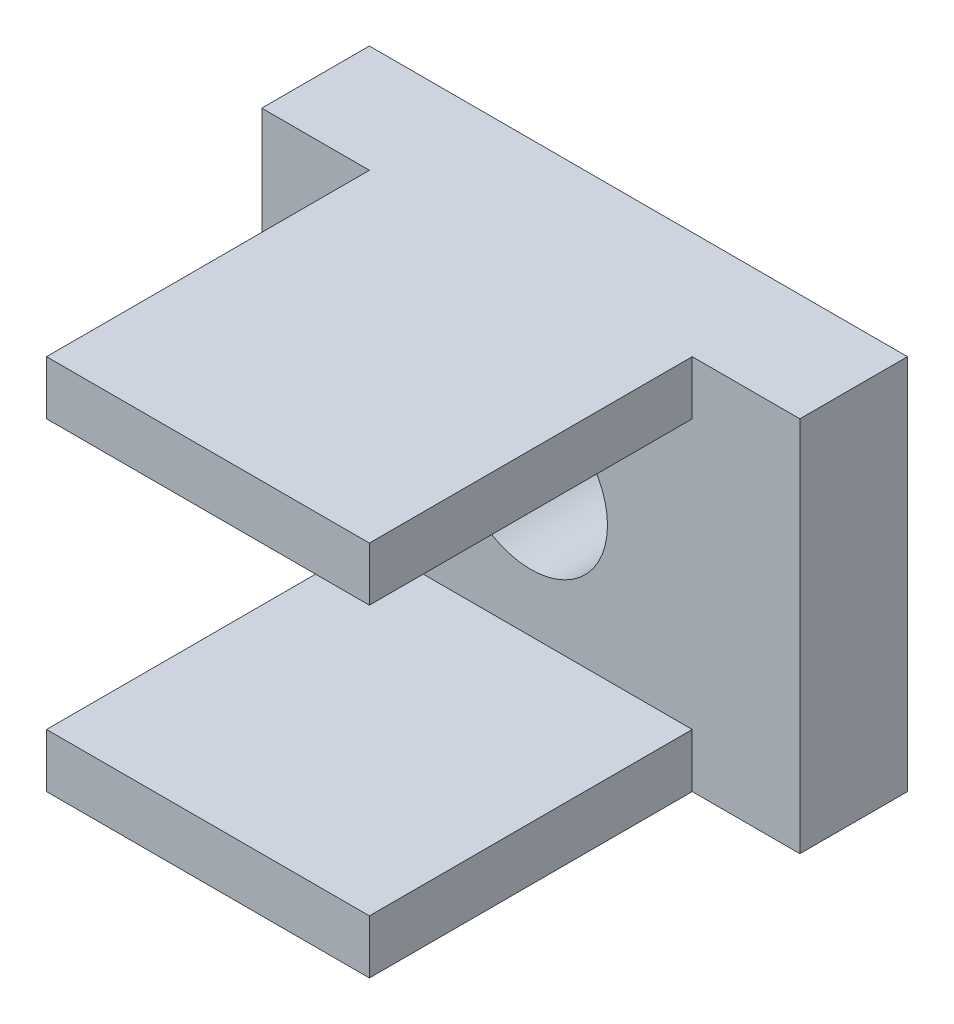
ISO-10303-21;
HEADER;
FILE_DESCRIPTION(('STEP AP214'),'2;1');
FILE_NAME('part.step','',(''),(''),'','','');
FILE_SCHEMA(('AUTOMOTIVE_DESIGN { 1 0 10303 214 1 1 1 1 }'));
ENDSEC;
DATA;
#1=APPLICATION_CONTEXT('core data for automotive mechanical design processes');
#2=APPLICATION_PROTOCOL_DEFINITION('international standard','automotive_design',2000,#1);
#3=PRODUCT_CONTEXT('',#1,'mechanical');
#4=PRODUCT('Part','Part','',(#3));
#5=PRODUCT_RELATED_PRODUCT_CATEGORY('part','',(#4));
#6=PRODUCT_DEFINITION_FORMATION('','',#4);
#7=PRODUCT_DEFINITION_CONTEXT('part definition',#1,'design');
#8=PRODUCT_DEFINITION('design','',#6,#7);
#9=PRODUCT_DEFINITION_SHAPE('','',#8);
#10=(LENGTH_UNIT() NAMED_UNIT(*) SI_UNIT(.MILLI.,.METRE.));
#11=(NAMED_UNIT(*) PLANE_ANGLE_UNIT() SI_UNIT($,.RADIAN.));
#12=(NAMED_UNIT(*) SI_UNIT($,.STERADIAN.) SOLID_ANGLE_UNIT());
#13=UNCERTAINTY_MEASURE_WITH_UNIT(LENGTH_MEASURE(1.E-05),#10,'distance_accuracy_value','');
#14=(GEOMETRIC_REPRESENTATION_CONTEXT(3) GLOBAL_UNCERTAINTY_ASSIGNED_CONTEXT((#13)) GLOBAL_UNIT_ASSIGNED_CONTEXT((#10,
#11,#12)) REPRESENTATION_CONTEXT('',''));
#15=CARTESIAN_POINT('',(0.,0.,0.));
#16=DIRECTION('',(0.,0.,1.));
#17=DIRECTION('',(1.,0.,0.));
#18=AXIS2_PLACEMENT_3D('',#15,#16,#17);
#19=CARTESIAN_POINT('',(0.,0.,2.));
#20=DIRECTION('',(0.,0.,1.));
#21=DIRECTION('',(1.,0.,0.));
#22=AXIS2_PLACEMENT_3D('',#19,#20,#21);
#23=PLANE('',#22);
#24=DIRECTION('',(0.,1.,0.));
#25=VECTOR('',#24,1.);
#26=CARTESIAN_POINT('',(-3.,-2.5,2.));
#27=LINE('',#26,#25);
#28=CARTESIAN_POINT('',(-3.,-3.5,2.));
#29=VERTEX_POINT('',#28);
#30=CARTESIAN_POINT('',(-3.,-2.5,2.));
#31=VERTEX_POINT('',#30);
#32=EDGE_CURVE('E55',#29,#31,#27,.T.);
#33=ORIENTED_EDGE('',*,*,#32,.T.);
#34=DIRECTION('',(1.,0.,0.));
#35=VECTOR('',#34,1.);
#36=CARTESIAN_POINT('',(3.,-2.5,2.));
#37=LINE('',#36,#35);
#38=CARTESIAN_POINT('',(3.,-2.5,2.));
#39=VERTEX_POINT('',#38);
#40=EDGE_CURVE('E60',#31,#39,#37,.T.);
#41=ORIENTED_EDGE('',*,*,#40,.T.);
#42=DIRECTION('',(0.,-1.,0.));
#43=VECTOR('',#42,1.);
#44=CARTESIAN_POINT('',(3.,-2.5,2.));
#45=LINE('',#44,#43);
#46=CARTESIAN_POINT('',(3.,-3.5,2.));
#47=VERTEX_POINT('',#46);
#48=EDGE_CURVE('E163',#39,#47,#45,.T.);
#49=ORIENTED_EDGE('',*,*,#48,.T.);
#50=DIRECTION('',(1.,0.,0.));
#51=VECTOR('',#50,1.);
#52=CARTESIAN_POINT('',(5.,-3.5,2.));
#53=LINE('',#52,#51);
#54=CARTESIAN_POINT('',(5.,-3.5,2.));
#55=VERTEX_POINT('',#54);
#56=EDGE_CURVE('E228',#47,#55,#53,.T.);
#57=ORIENTED_EDGE('',*,*,#56,.T.);
#58=DIRECTION('',(0.,1.,0.));
#59=VECTOR('',#58,1.);
#60=CARTESIAN_POINT('',(5.,-3.5,2.));
#61=LINE('',#60,#59);
#62=CARTESIAN_POINT('',(5.,3.5,2.));
#63=VERTEX_POINT('',#62);
#64=EDGE_CURVE('E233',#55,#63,#61,.T.);
#65=ORIENTED_EDGE('',*,*,#64,.T.);
#66=DIRECTION('',(-1.,0.,0.));
#67=VECTOR('',#66,1.);
#68=CARTESIAN_POINT('',(5.,3.5,2.));
#69=LINE('',#68,#67);
#70=CARTESIAN_POINT('',(3.,3.5,2.));
#71=VERTEX_POINT('',#70);
#72=EDGE_CURVE('E237',#63,#71,#69,.T.);
#73=ORIENTED_EDGE('',*,*,#72,.T.);
#74=DIRECTION('',(0.,1.,0.));
#75=VECTOR('',#74,1.);
#76=CARTESIAN_POINT('',(3.,2.5,2.));
#77=LINE('',#76,#75);
#78=CARTESIAN_POINT('',(3.,2.5,2.));
#79=VERTEX_POINT('',#78);
#80=EDGE_CURVE('E180',#79,#71,#77,.T.);
#81=ORIENTED_EDGE('',*,*,#80,.F.);
#82=DIRECTION('',(1.,0.,0.));
#83=VECTOR('',#82,1.);
#84=CARTESIAN_POINT('',(3.,2.5,2.));
#85=LINE('',#84,#83);
#86=CARTESIAN_POINT('',(-3.,2.5,2.));
#87=VERTEX_POINT('',#86);
#88=EDGE_CURVE('E193',#87,#79,#85,.T.);
#89=ORIENTED_EDGE('',*,*,#88,.F.);
#90=DIRECTION('',(0.,-1.,0.));
#91=VECTOR('',#90,1.);
#92=CARTESIAN_POINT('',(-3.,2.5,2.));
#93=LINE('',#92,#91);
#94=CARTESIAN_POINT('',(-3.,3.5,2.));
#95=VERTEX_POINT('',#94);
#96=EDGE_CURVE('E137',#95,#87,#93,.T.);
#97=ORIENTED_EDGE('',*,*,#96,.F.);
#98=CARTESIAN_POINT('',(-5.,3.5,2.));
#99=VERTEX_POINT('',#98);
#100=EDGE_CURVE('E236',#95,#99,#69,.T.);
#101=ORIENTED_EDGE('',*,*,#100,.T.);
#102=DIRECTION('',(0.,-1.,0.));
#103=VECTOR('',#102,1.);
#104=CARTESIAN_POINT('',(-5.,-3.5,2.));
#105=LINE('',#104,#103);
#106=CARTESIAN_POINT('',(-5.,-3.5,2.));
#107=VERTEX_POINT('',#106);
#108=EDGE_CURVE('E224',#99,#107,#105,.T.);
#109=ORIENTED_EDGE('',*,*,#108,.T.);
#110=EDGE_CURVE('E230',#107,#29,#53,.T.);
#111=ORIENTED_EDGE('',*,*,#110,.T.);
#112=EDGE_LOOP('',(#33,#41,#49,#57,#65,#73,#81,#89,#97,#101,#109,#111));
#113=FACE_BOUND('',#112,.T.);
#114=CARTESIAN_POINT('',(0.,0.,2.));
#115=DIRECTION('',(0.,0.,1.));
#116=DIRECTION('',(1.,0.,0.));
#117=AXIS2_PLACEMENT_3D('',#114,#115,#116);
#118=CIRCLE('',#117,1.425);
#119=CARTESIAN_POINT('',(1.425,0.,2.));
#120=VERTEX_POINT('',#119);
#121=EDGE_CURVE('E216',#120,#120,#118,.T.);
#122=ORIENTED_EDGE('',*,*,#121,.F.);
#123=EDGE_LOOP('',(#122));
#124=FACE_BOUND('',#123,.T.);
#125=ADVANCED_FACE('F39',(#113,#124),#23,.T.);
#126=CARTESIAN_POINT('',(0.,0.,0.));
#127=DIRECTION('',(0.,0.,1.));
#128=DIRECTION('',(1.,0.,0.));
#129=AXIS2_PLACEMENT_3D('',#126,#127,#128);
#130=PLANE('',#129);
#131=DIRECTION('',(0.,-1.,0.));
#132=VECTOR('',#131,1.);
#133=CARTESIAN_POINT('',(-5.,-3.5,0.));
#134=LINE('',#133,#132);
#135=CARTESIAN_POINT('',(-5.,3.5,0.));
#136=VERTEX_POINT('',#135);
#137=CARTESIAN_POINT('',(-5.,-3.5,0.));
#138=VERTEX_POINT('',#137);
#139=EDGE_CURVE('E220',#136,#138,#134,.T.);
#140=ORIENTED_EDGE('',*,*,#139,.F.);
#141=DIRECTION('',(-1.,0.,0.));
#142=VECTOR('',#141,1.);
#143=CARTESIAN_POINT('',(5.,3.5,0.));
#144=LINE('',#143,#142);
#145=CARTESIAN_POINT('',(5.,3.5,0.));
#146=VERTEX_POINT('',#145);
#147=EDGE_CURVE('E229',#146,#136,#144,.T.);
#148=ORIENTED_EDGE('',*,*,#147,.F.);
#149=DIRECTION('',(0.,1.,0.));
#150=VECTOR('',#149,1.);
#151=CARTESIAN_POINT('',(5.,-3.5,0.));
#152=LINE('',#151,#150);
#153=CARTESIAN_POINT('',(5.,-3.5,0.));
#154=VERTEX_POINT('',#153);
#155=EDGE_CURVE('E247',#154,#146,#152,.T.);
#156=ORIENTED_EDGE('',*,*,#155,.F.);
#157=DIRECTION('',(1.,0.,0.));
#158=VECTOR('',#157,1.);
#159=CARTESIAN_POINT('',(5.,-3.5,0.));
#160=LINE('',#159,#158);
#161=EDGE_CURVE('E244',#138,#154,#160,.T.);
#162=ORIENTED_EDGE('',*,*,#161,.F.);
#163=EDGE_LOOP('',(#140,#148,#156,#162));
#164=FACE_BOUND('',#163,.T.);
#165=CARTESIAN_POINT('',(0.,0.,0.));
#166=DIRECTION('',(0.,0.,1.));
#167=DIRECTION('',(1.,0.,0.));
#168=AXIS2_PLACEMENT_3D('',#165,#166,#167);
#169=CIRCLE('',#168,1.425);
#170=CARTESIAN_POINT('',(1.425,0.,0.));
#171=VERTEX_POINT('',#170);
#172=EDGE_CURVE('E215',#171,#171,#169,.T.);
#173=ORIENTED_EDGE('',*,*,#172,.T.);
#174=EDGE_LOOP('',(#173));
#175=FACE_BOUND('',#174,.T.);
#176=ADVANCED_FACE('F269',(#164,#175),#130,.F.);
#177=CARTESIAN_POINT('',(-5.,-3.5,2.));
#178=DIRECTION('',(1.,0.,0.));
#179=DIRECTION('',(0.,0.,-1.));
#180=AXIS2_PLACEMENT_3D('',#177,#178,#179);
#181=PLANE('',#180);
#182=ORIENTED_EDGE('',*,*,#139,.T.);
#183=DIRECTION('',(0.,0.,-1.));
#184=VECTOR('',#183,1.);
#185=CARTESIAN_POINT('',(-5.,-3.5,2.));
#186=LINE('',#185,#184);
#187=EDGE_CURVE('E11',#107,#138,#186,.T.);
#188=ORIENTED_EDGE('',*,*,#187,.F.);
#189=ORIENTED_EDGE('',*,*,#108,.F.);
#190=DIRECTION('',(0.,0.,-1.));
#191=VECTOR('',#190,1.);
#192=CARTESIAN_POINT('',(-5.,3.5,2.));
#193=LINE('',#192,#191);
#194=EDGE_CURVE('E240',#99,#136,#193,.T.);
#195=ORIENTED_EDGE('',*,*,#194,.T.);
#196=EDGE_LOOP('',(#182,#188,#189,#195));
#197=FACE_BOUND('',#196,.T.);
#198=ADVANCED_FACE('F41',(#197),#181,.F.);
#199=CARTESIAN_POINT('',(5.,-3.5,2.));
#200=DIRECTION('',(0.,1.,0.));
#201=DIRECTION('',(-1.,0.,0.));
#202=AXIS2_PLACEMENT_3D('',#199,#200,#201);
#203=PLANE('',#202);
#204=ORIENTED_EDGE('',*,*,#161,.T.);
#205=DIRECTION('',(0.,0.,-1.));
#206=VECTOR('',#205,1.);
#207=CARTESIAN_POINT('',(5.,-3.5,2.));
#208=LINE('',#207,#206);
#209=EDGE_CURVE('E48',#55,#154,#208,.T.);
#210=ORIENTED_EDGE('',*,*,#209,.F.);
#211=ORIENTED_EDGE('',*,*,#56,.F.);
#212=DIRECTION('',(0.,0.,-1.));
#213=VECTOR('',#212,1.);
#214=CARTESIAN_POINT('',(3.,-3.5,8.));
#215=LINE('',#214,#213);
#216=CARTESIAN_POINT('',(3.,-3.5,8.));
#217=VERTEX_POINT('',#216);
#218=EDGE_CURVE('E138',#217,#47,#215,.T.);
#219=ORIENTED_EDGE('',*,*,#218,.F.);
#220=DIRECTION('',(-1.,0.,0.));
#221=VECTOR('',#220,1.);
#222=CARTESIAN_POINT('',(3.,-3.5,8.));
#223=LINE('',#222,#221);
#224=CARTESIAN_POINT('',(-3.,-3.5,8.));
#225=VERTEX_POINT('',#224);
#226=EDGE_CURVE('E144',#217,#225,#223,.T.);
#227=ORIENTED_EDGE('',*,*,#226,.T.);
#228=DIRECTION('',(0.,0.,-1.));
#229=VECTOR('',#228,1.);
#230=CARTESIAN_POINT('',(-3.,-3.5,8.));
#231=LINE('',#230,#229);
#232=EDGE_CURVE('E129',#225,#29,#231,.T.);
#233=ORIENTED_EDGE('',*,*,#232,.T.);
#234=ORIENTED_EDGE('',*,*,#110,.F.);
#235=ORIENTED_EDGE('',*,*,#187,.T.);
#236=EDGE_LOOP('',(#204,#210,#211,#219,#227,#233,#234,#235));
#237=FACE_BOUND('',#236,.T.);
#238=ADVANCED_FACE('F150',(#237),#203,.F.);
#239=CARTESIAN_POINT('',(5.,-3.5,2.));
#240=DIRECTION('',(-1.,0.,0.));
#241=DIRECTION('',(0.,0.,1.));
#242=AXIS2_PLACEMENT_3D('',#239,#240,#241);
#243=PLANE('',#242);
#244=ORIENTED_EDGE('',*,*,#155,.T.);
#245=DIRECTION('',(0.,0.,-1.));
#246=VECTOR('',#245,1.);
#247=CARTESIAN_POINT('',(5.,3.5,2.));
#248=LINE('',#247,#246);
#249=EDGE_CURVE('E255',#63,#146,#248,.T.);
#250=ORIENTED_EDGE('',*,*,#249,.F.);
#251=ORIENTED_EDGE('',*,*,#64,.F.);
#252=ORIENTED_EDGE('',*,*,#209,.T.);
#253=EDGE_LOOP('',(#244,#250,#251,#252));
#254=FACE_BOUND('',#253,.T.);
#255=ADVANCED_FACE('F264',(#254),#243,.F.);
#256=CARTESIAN_POINT('',(5.,3.5,2.));
#257=DIRECTION('',(0.,-1.,0.));
#258=DIRECTION('',(1.,0.,0.));
#259=AXIS2_PLACEMENT_3D('',#256,#257,#258);
#260=PLANE('',#259);
#261=ORIENTED_EDGE('',*,*,#147,.T.);
#262=ORIENTED_EDGE('',*,*,#194,.F.);
#263=ORIENTED_EDGE('',*,*,#100,.F.);
#264=DIRECTION('',(0.,0.,-1.));
#265=VECTOR('',#264,1.);
#266=CARTESIAN_POINT('',(-3.,3.5,8.));
#267=LINE('',#266,#265);
#268=CARTESIAN_POINT('',(-3.,3.5,8.));
#269=VERTEX_POINT('',#268);
#270=EDGE_CURVE('E189',#269,#95,#267,.T.);
#271=ORIENTED_EDGE('',*,*,#270,.F.);
#272=DIRECTION('',(-1.,0.,0.));
#273=VECTOR('',#272,1.);
#274=CARTESIAN_POINT('',(3.,3.5,8.));
#275=LINE('',#274,#273);
#276=CARTESIAN_POINT('',(3.,3.5,8.));
#277=VERTEX_POINT('',#276);
#278=EDGE_CURVE('E186',#277,#269,#275,.T.);
#279=ORIENTED_EDGE('',*,*,#278,.F.);
#280=DIRECTION('',(0.,0.,-1.));
#281=VECTOR('',#280,1.);
#282=CARTESIAN_POINT('',(3.,3.5,8.));
#283=LINE('',#282,#281);
#284=EDGE_CURVE('E203',#277,#71,#283,.T.);
#285=ORIENTED_EDGE('',*,*,#284,.T.);
#286=ORIENTED_EDGE('',*,*,#72,.F.);
#287=ORIENTED_EDGE('',*,*,#249,.T.);
#288=EDGE_LOOP('',(#261,#262,#263,#271,#279,#285,#286,#287));
#289=FACE_BOUND('',#288,.T.);
#290=ADVANCED_FACE('F273',(#289),#260,.F.);
#291=CARTESIAN_POINT('',(0.,0.,2.));
#292=DIRECTION('',(0.,0.,-1.));
#293=DIRECTION('',(-1.,0.,0.));
#294=AXIS2_PLACEMENT_3D('',#291,#292,#293);
#295=CYLINDRICAL_SURFACE('',#294,1.425);
#296=ORIENTED_EDGE('',*,*,#121,.T.);
#297=EDGE_LOOP('',(#296));
#298=FACE_BOUND('',#297,.T.);
#299=ORIENTED_EDGE('',*,*,#172,.F.);
#300=EDGE_LOOP('',(#299));
#301=FACE_BOUND('',#300,.T.);
#302=ADVANCED_FACE('F303',(#298,#301),#295,.F.);
#303=CARTESIAN_POINT('',(-3.,2.5,8.));
#304=DIRECTION('',(1.,0.,0.));
#305=DIRECTION('',(0.,1.,0.));
#306=AXIS2_PLACEMENT_3D('',#303,#304,#305);
#307=PLANE('',#306);
#308=ORIENTED_EDGE('',*,*,#96,.T.);
#309=DIRECTION('',(0.,0.,-1.));
#310=VECTOR('',#309,1.);
#311=CARTESIAN_POINT('',(-3.,2.5,8.));
#312=LINE('',#311,#310);
#313=CARTESIAN_POINT('',(-3.,2.5,8.));
#314=VERTEX_POINT('',#313);
#315=EDGE_CURVE('E211',#314,#87,#312,.T.);
#316=ORIENTED_EDGE('',*,*,#315,.F.);
#317=DIRECTION('',(0.,-1.,0.));
#318=VECTOR('',#317,1.);
#319=CARTESIAN_POINT('',(-3.,2.5,8.));
#320=LINE('',#319,#318);
#321=EDGE_CURVE('E175',#269,#314,#320,.T.);
#322=ORIENTED_EDGE('',*,*,#321,.F.);
#323=ORIENTED_EDGE('',*,*,#270,.T.);
#324=EDGE_LOOP('',(#308,#316,#322,#323));
#325=FACE_BOUND('',#324,.T.);
#326=ADVANCED_FACE('F354',(#325),#307,.F.);
#327=CARTESIAN_POINT('',(3.,2.5,8.));
#328=DIRECTION('',(0.,1.,0.));
#329=DIRECTION('',(-1.,0.,0.));
#330=AXIS2_PLACEMENT_3D('',#327,#328,#329);
#331=PLANE('',#330);
#332=ORIENTED_EDGE('',*,*,#88,.T.);
#333=DIRECTION('',(0.,0.,-1.));
#334=VECTOR('',#333,1.);
#335=CARTESIAN_POINT('',(3.,2.5,8.));
#336=LINE('',#335,#334);
#337=CARTESIAN_POINT('',(3.,2.5,8.));
#338=VERTEX_POINT('',#337);
#339=EDGE_CURVE('E207',#338,#79,#336,.T.);
#340=ORIENTED_EDGE('',*,*,#339,.F.);
#341=DIRECTION('',(1.,0.,0.));
#342=VECTOR('',#341,1.);
#343=CARTESIAN_POINT('',(3.,2.5,8.));
#344=LINE('',#343,#342);
#345=EDGE_CURVE('E179',#314,#338,#344,.T.);
#346=ORIENTED_EDGE('',*,*,#345,.F.);
#347=ORIENTED_EDGE('',*,*,#315,.T.);
#348=EDGE_LOOP('',(#332,#340,#346,#347));
#349=FACE_BOUND('',#348,.T.);
#350=ADVANCED_FACE('F364',(#349),#331,.F.);
#351=CARTESIAN_POINT('',(3.,2.5,8.));
#352=DIRECTION('',(-1.,0.,0.));
#353=DIRECTION('',(0.,0.,1.));
#354=AXIS2_PLACEMENT_3D('',#351,#352,#353);
#355=PLANE('',#354);
#356=ORIENTED_EDGE('',*,*,#80,.T.);
#357=ORIENTED_EDGE('',*,*,#284,.F.);
#358=DIRECTION('',(0.,1.,0.));
#359=VECTOR('',#358,1.);
#360=CARTESIAN_POINT('',(3.,2.5,8.));
#361=LINE('',#360,#359);
#362=EDGE_CURVE('E183',#338,#277,#361,.T.);
#363=ORIENTED_EDGE('',*,*,#362,.F.);
#364=ORIENTED_EDGE('',*,*,#339,.T.);
#365=EDGE_LOOP('',(#356,#357,#363,#364));
#366=FACE_BOUND('',#365,.T.);
#367=ADVANCED_FACE('F373',(#366),#355,.F.);
#368=CARTESIAN_POINT('',(0.,0.,8.));
#369=DIRECTION('',(0.,0.,1.));
#370=DIRECTION('',(1.,0.,0.));
#371=AXIS2_PLACEMENT_3D('',#368,#369,#370);
#372=PLANE('',#371);
#373=ORIENTED_EDGE('',*,*,#321,.T.);
#374=ORIENTED_EDGE('',*,*,#345,.T.);
#375=ORIENTED_EDGE('',*,*,#362,.T.);
#376=ORIENTED_EDGE('',*,*,#278,.T.);
#377=EDGE_LOOP('',(#373,#374,#375,#376));
#378=FACE_BOUND('',#377,.T.);
#379=ADVANCED_FACE('F383',(#378),#372,.T.);
#380=CARTESIAN_POINT('',(-3.,-2.5,8.));
#381=DIRECTION('',(-1.,0.,0.));
#382=DIRECTION('',(0.,-1.,0.));
#383=AXIS2_PLACEMENT_3D('',#380,#381,#382);
#384=PLANE('',#383);
#385=ORIENTED_EDGE('',*,*,#32,.F.);
#386=ORIENTED_EDGE('',*,*,#232,.F.);
#387=DIRECTION('',(0.,1.,0.));
#388=VECTOR('',#387,1.);
#389=CARTESIAN_POINT('',(-3.,-2.5,8.));
#390=LINE('',#389,#388);
#391=CARTESIAN_POINT('',(-3.,-2.5,8.));
#392=VERTEX_POINT('',#391);
#393=EDGE_CURVE('E132',#225,#392,#390,.T.);
#394=ORIENTED_EDGE('',*,*,#393,.T.);
#395=DIRECTION('',(0.,0.,-1.));
#396=VECTOR('',#395,1.);
#397=CARTESIAN_POINT('',(-3.,-2.5,8.));
#398=LINE('',#397,#396);
#399=EDGE_CURVE('E160',#392,#31,#398,.T.);
#400=ORIENTED_EDGE('',*,*,#399,.T.);
#401=EDGE_LOOP('',(#385,#386,#394,#400));
#402=FACE_BOUND('',#401,.T.);
#403=ADVANCED_FACE('F131',(#402),#384,.T.);
#404=CARTESIAN_POINT('',(3.,-2.5,8.));
#405=DIRECTION('',(1.,0.,0.));
#406=DIRECTION('',(0.,0.,-1.));
#407=AXIS2_PLACEMENT_3D('',#404,#405,#406);
#408=PLANE('',#407);
#409=ORIENTED_EDGE('',*,*,#48,.F.);
#410=DIRECTION('',(0.,0.,-1.));
#411=VECTOR('',#410,1.);
#412=CARTESIAN_POINT('',(3.,-2.5,8.));
#413=LINE('',#412,#411);
#414=CARTESIAN_POINT('',(3.,-2.5,8.));
#415=VERTEX_POINT('',#414);
#416=EDGE_CURVE('E170',#415,#39,#413,.T.);
#417=ORIENTED_EDGE('',*,*,#416,.F.);
#418=DIRECTION('',(0.,-1.,0.));
#419=VECTOR('',#418,1.);
#420=CARTESIAN_POINT('',(3.,-2.5,8.));
#421=LINE('',#420,#419);
#422=EDGE_CURVE('E153',#415,#217,#421,.T.);
#423=ORIENTED_EDGE('',*,*,#422,.T.);
#424=ORIENTED_EDGE('',*,*,#218,.T.);
#425=EDGE_LOOP('',(#409,#417,#423,#424));
#426=FACE_BOUND('',#425,.T.);
#427=ADVANCED_FACE('F285',(#426),#408,.T.);
#428=CARTESIAN_POINT('',(3.,-2.5,8.));
#429=DIRECTION('',(0.,1.,0.));
#430=DIRECTION('',(-1.,0.,0.));
#431=AXIS2_PLACEMENT_3D('',#428,#429,#430);
#432=PLANE('',#431);
#433=ORIENTED_EDGE('',*,*,#40,.F.);
#434=ORIENTED_EDGE('',*,*,#399,.F.);
#435=DIRECTION('',(1.,0.,0.));
#436=VECTOR('',#435,1.);
#437=CARTESIAN_POINT('',(3.,-2.5,8.));
#438=LINE('',#437,#436);
#439=EDGE_CURVE('E147',#392,#415,#438,.T.);
#440=ORIENTED_EDGE('',*,*,#439,.T.);
#441=ORIENTED_EDGE('',*,*,#416,.T.);
#442=EDGE_LOOP('',(#433,#434,#440,#441));
#443=FACE_BOUND('',#442,.T.);
#444=ADVANCED_FACE('F287',(#443),#432,.T.);
#445=CARTESIAN_POINT('',(0.,0.,8.));
#446=DIRECTION('',(0.,0.,1.));
#447=DIRECTION('',(1.,0.,0.));
#448=AXIS2_PLACEMENT_3D('',#445,#446,#447);
#449=PLANE('',#448);
#450=ORIENTED_EDGE('',*,*,#393,.F.);
#451=ORIENTED_EDGE('',*,*,#226,.F.);
#452=ORIENTED_EDGE('',*,*,#422,.F.);
#453=ORIENTED_EDGE('',*,*,#439,.F.);
#454=EDGE_LOOP('',(#450,#451,#452,#453));
#455=FACE_BOUND('',#454,.T.);
#456=ADVANCED_FACE('F142',(#455),#449,.T.);
#457=CLOSED_SHELL('',(#125,#176,#198,#238,#255,#290,#302,#326,#350,#367,#379,#403,#427,#444,#456));
#458=MANIFOLD_SOLID_BREP('B2',#457);
#459=ADVANCED_BREP_SHAPE_REPRESENTATION('',(#18,#458),#14);
#460=SHAPE_DEFINITION_REPRESENTATION(#9,#459);
ENDSEC;
END-ISO-10303-21;
